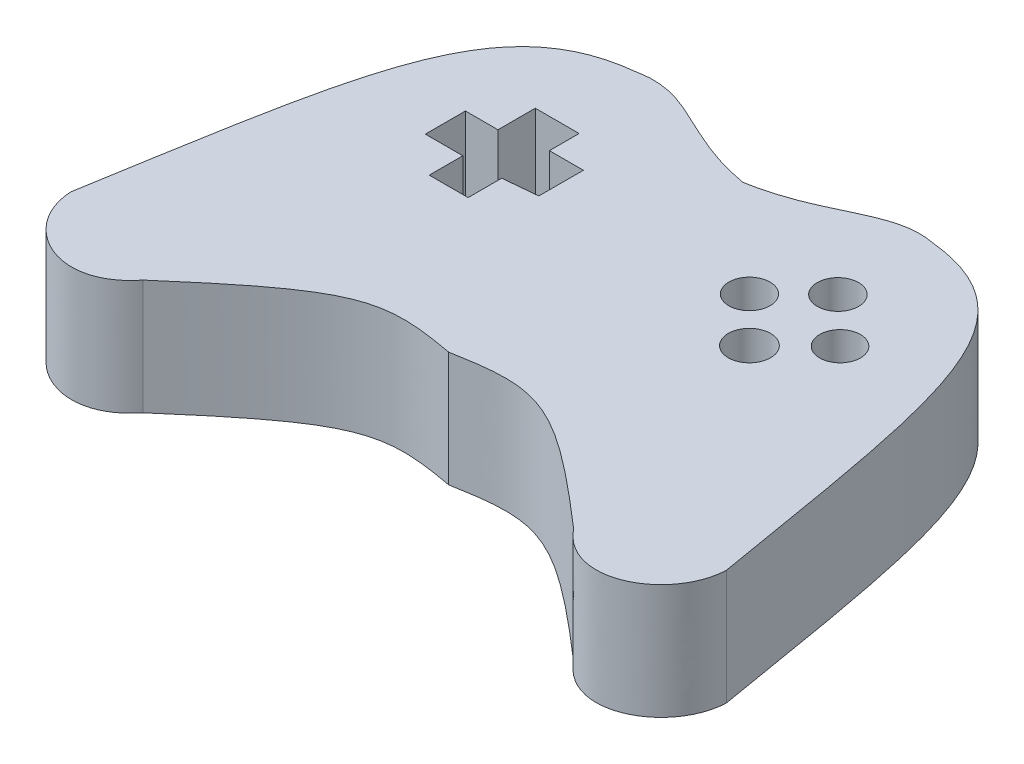
ISO-10303-21;
HEADER;
FILE_DESCRIPTION(('STEP AP214'),'2;1');
FILE_NAME('part.step','',(''),(''),'','','');
FILE_SCHEMA(('AUTOMOTIVE_DESIGN { 1 0 10303 214 1 1 1 1 }'));
ENDSEC;
DATA;
#1=APPLICATION_CONTEXT('core data for automotive mechanical design processes');
#2=APPLICATION_PROTOCOL_DEFINITION('international standard','automotive_design',2000,#1);
#3=PRODUCT_CONTEXT('',#1,'mechanical');
#4=PRODUCT('Part','Part','',(#3));
#5=PRODUCT_RELATED_PRODUCT_CATEGORY('part','',(#4));
#6=PRODUCT_DEFINITION_FORMATION('','',#4);
#7=PRODUCT_DEFINITION_CONTEXT('part definition',#1,'design');
#8=PRODUCT_DEFINITION('design','',#6,#7);
#9=PRODUCT_DEFINITION_SHAPE('','',#8);
#10=(LENGTH_UNIT() NAMED_UNIT(*) SI_UNIT(.MILLI.,.METRE.));
#11=(NAMED_UNIT(*) PLANE_ANGLE_UNIT() SI_UNIT($,.RADIAN.));
#12=(NAMED_UNIT(*) SI_UNIT($,.STERADIAN.) SOLID_ANGLE_UNIT());
#13=UNCERTAINTY_MEASURE_WITH_UNIT(LENGTH_MEASURE(1.E-05),#10,'distance_accuracy_value','');
#14=(GEOMETRIC_REPRESENTATION_CONTEXT(3) GLOBAL_UNCERTAINTY_ASSIGNED_CONTEXT((#13)) GLOBAL_UNIT_ASSIGNED_CONTEXT((#10,
#11,#12)) REPRESENTATION_CONTEXT('',''));
#15=CARTESIAN_POINT('',(0.,0.,0.));
#16=DIRECTION('',(0.,0.,1.));
#17=DIRECTION('',(1.,0.,0.));
#18=AXIS2_PLACEMENT_3D('',#15,#16,#17);
#19=CARTESIAN_POINT('',(10.9520559844828,2.,-8.68200228098317));
#20=DIRECTION('',(0.,-1.,0.));
#21=DIRECTION('',(0.,0.,-1.));
#22=AXIS2_PLACEMENT_3D('',#19,#20,#21);
#23=PLANE('',#22);
#24=CARTESIAN_POINT('',(12.0932653668984,2.,-8.90683532947978));
#25=CARTESIAN_POINT('',(11.2479259351028,2.,-9.07590321583892));
#26=CARTESIAN_POINT('',(10.7545368823652,2.,-8.3841668893106));
#27=CARTESIAN_POINT('',(9.51579405655997,2.,-8.16897260293703));
#28=B_SPLINE_CURVE_WITH_KNOTS('',3,(#24,#25,#26,#27),.UNSPECIFIED.,.F.,.F.,(4,4),(0.,1.),.UNSPECIFIED.);
#29=CARTESIAN_POINT('',(12.0932653668984,2.,-8.90683532947978));
#30=VERTEX_POINT('',#29);
#31=CARTESIAN_POINT('',(9.51579405655997,2.,-8.16897260293703));
#32=VERTEX_POINT('',#31);
#33=EDGE_CURVE('E263',#30,#32,#28,.T.);
#34=ORIENTED_EDGE('',*,*,#33,.T.);
#35=CARTESIAN_POINT('',(9.51579405655997,2.,-8.16897260293703));
#36=CARTESIAN_POINT('',(8.27705123075474,2.,-8.3841668893106));
#37=CARTESIAN_POINT('',(7.78366217801717,2.,-9.07590321583892));
#38=CARTESIAN_POINT('',(6.9383227462215,2.,-8.90683532947978));
#39=B_SPLINE_CURVE_WITH_KNOTS('',3,(#35,#36,#37,#38),.UNSPECIFIED.,.F.,.F.,(4,4),(0.,1.),.UNSPECIFIED.);
#40=CARTESIAN_POINT('',(6.9383227462215,2.,-8.90683532947978));
#41=VERTEX_POINT('',#40);
#42=EDGE_CURVE('E269',#32,#41,#39,.T.);
#43=ORIENTED_EDGE('',*,*,#42,.T.);
#44=CARTESIAN_POINT('',(6.9383227462215,2.,-8.90683532947978));
#45=CARTESIAN_POINT('',(4.78622375194256,2.,-8.67625329437847));
#46=CARTESIAN_POINT('',(4.56793449938139,2.,-6.6378823643764));
#47=CARTESIAN_POINT('',(3.81470387052384,2.,-2.17998680583167));
#48=B_SPLINE_CURVE_WITH_KNOTS('',3,(#44,#45,#46,#47),.UNSPECIFIED.,.F.,.F.,(4,4),(0.,1.),.UNSPECIFIED.);
#49=CARTESIAN_POINT('',(3.81470387052384,2.,-2.17998680583167));
#50=VERTEX_POINT('',#49);
#51=EDGE_CURVE('E278',#41,#50,#48,.T.);
#52=ORIENTED_EDGE('',*,*,#51,.T.);
#53=CARTESIAN_POINT('',(3.81470387052384,2.,-2.17998680583167));
#54=CARTESIAN_POINT('',(3.85569382971372,2.,-1.23721774446444));
#55=CARTESIAN_POINT('',(5.06294709652017,2.,-0.587465172967495));
#56=CARTESIAN_POINT('',(5.77004009586214,2.,-1.47901721561606));
#57=B_SPLINE_CURVE_WITH_KNOTS('',3,(#53,#54,#55,#56),.UNSPECIFIED.,.F.,.F.,(4,4),(0.,1.),.UNSPECIFIED.);
#58=CARTESIAN_POINT('',(5.77004009586214,2.,-1.47901721561606));
#59=VERTEX_POINT('',#58);
#60=EDGE_CURVE('E301',#50,#59,#57,.T.);
#61=ORIENTED_EDGE('',*,*,#60,.T.);
#62=CARTESIAN_POINT('',(5.77004009586213,2.,-1.47901721561606));
#63=CARTESIAN_POINT('',(7.78377159732675,2.,-3.2314247817761));
#64=CARTESIAN_POINT('',(8.15406491330064,2.,-3.29906397158742));
#65=CARTESIAN_POINT('',(9.51579405655997,2.,-3.05312436557393));
#66=B_SPLINE_CURVE_WITH_KNOTS('',3,(#62,#63,#64,#65),.UNSPECIFIED.,.F.,.F.,(4,4),(0.,1.),.UNSPECIFIED.);
#67=CARTESIAN_POINT('',(9.51579405655997,2.,-3.05312436557393));
#68=VERTEX_POINT('',#67);
#69=EDGE_CURVE('E305',#59,#68,#66,.T.);
#70=ORIENTED_EDGE('',*,*,#69,.T.);
#71=CARTESIAN_POINT('',(9.51579405655996,2.,-3.05312436557393));
#72=CARTESIAN_POINT('',(10.8775231998193,2.,-3.29906397158742));
#73=CARTESIAN_POINT('',(11.2478165157932,2.,-3.2314247817761));
#74=CARTESIAN_POINT('',(13.2615480172578,2.,-1.47901721561606));
#75=B_SPLINE_CURVE_WITH_KNOTS('',3,(#71,#72,#73,#74),.UNSPECIFIED.,.F.,.F.,(4,4),(0.,1.),.UNSPECIFIED.);
#76=CARTESIAN_POINT('',(13.2615480172578,2.,-1.47901721561606));
#77=VERTEX_POINT('',#76);
#78=EDGE_CURVE('E313',#68,#77,#75,.T.);
#79=ORIENTED_EDGE('',*,*,#78,.T.);
#80=CARTESIAN_POINT('',(13.2615480172578,2.,-1.47901721561606));
#81=CARTESIAN_POINT('',(13.9686410165998,2.,-0.587465172967495));
#82=CARTESIAN_POINT('',(15.1758942834062,2.,-1.23721774446444));
#83=CARTESIAN_POINT('',(15.2168842425961,2.,-2.17998680583167));
#84=B_SPLINE_CURVE_WITH_KNOTS('',3,(#80,#81,#82,#83),.UNSPECIFIED.,.F.,.F.,(4,4),(0.,1.),.UNSPECIFIED.);
#85=CARTESIAN_POINT('',(15.2168842425961,2.,-2.17998680583167));
#86=VERTEX_POINT('',#85);
#87=EDGE_CURVE('E321',#77,#86,#84,.T.);
#88=ORIENTED_EDGE('',*,*,#87,.T.);
#89=CARTESIAN_POINT('',(15.2168842425961,2.,-2.17998680583167));
#90=CARTESIAN_POINT('',(14.4636536137385,2.,-6.6378823643764));
#91=CARTESIAN_POINT('',(14.2453643611774,2.,-8.67625329437847));
#92=CARTESIAN_POINT('',(12.0932653668984,2.,-8.90683532947978));
#93=B_SPLINE_CURVE_WITH_KNOTS('',3,(#89,#90,#91,#92),.UNSPECIFIED.,.F.,.F.,(4,4),(0.,1.),.UNSPECIFIED.);
#94=EDGE_CURVE('E343',#86,#30,#93,.T.);
#95=ORIENTED_EDGE('',*,*,#94,.T.);
#96=EDGE_LOOP('',(#34,#43,#52,#61,#70,#79,#88,#95));
#97=FACE_BOUND('',#96,.T.);
#98=DIRECTION('',(0.,0.,1.));
#99=VECTOR('',#98,1.);
#100=CARTESIAN_POINT('',(6.59398680716821,2.,-6.83105667385962));
#101=LINE('',#100,#99);
#102=CARTESIAN_POINT('',(6.59398680716821,2.,-7.48030072483046));
#103=VERTEX_POINT('',#102);
#104=CARTESIAN_POINT('',(6.59398680716821,2.,-6.83105667385962));
#105=VERTEX_POINT('',#104);
#106=EDGE_CURVE('E173',#103,#105,#101,.T.);
#107=ORIENTED_EDGE('',*,*,#106,.F.);
#108=DIRECTION('',(-1.,0.,0.));
#109=VECTOR('',#108,1.);
#110=CARTESIAN_POINT('',(6.59398680716821,2.,-7.48030072483046));
#111=LINE('',#110,#109);
#112=CARTESIAN_POINT('',(7.35644495792906,2.,-7.48030072483046));
#113=VERTEX_POINT('',#112);
#114=EDGE_CURVE('E168',#113,#103,#111,.T.);
#115=ORIENTED_EDGE('',*,*,#114,.F.);
#116=DIRECTION('',(0.,0.,-1.));
#117=VECTOR('',#116,1.);
#118=CARTESIAN_POINT('',(7.35644495792906,2.,-7.48030072483046));
#119=LINE('',#118,#117);
#120=CARTESIAN_POINT('',(7.35644495792906,2.,-6.96379681625053));
#121=VERTEX_POINT('',#120);
#122=EDGE_CURVE('E209',#121,#113,#119,.T.);
#123=ORIENTED_EDGE('',*,*,#122,.F.);
#124=DIRECTION('',(-1.,0.,0.));
#125=VECTOR('',#124,1.);
#126=CARTESIAN_POINT('',(7.35644495792906,2.,-6.96379681625053));
#127=LINE('',#126,#125);
#128=CARTESIAN_POINT('',(7.94673513916326,2.,-6.96379681625053));
#129=VERTEX_POINT('',#128);
#130=EDGE_CURVE('E207',#129,#121,#127,.T.);
#131=ORIENTED_EDGE('',*,*,#130,.F.);
#132=DIRECTION('',(0.,0.,-1.));
#133=VECTOR('',#132,1.);
#134=CARTESIAN_POINT('',(7.94673513916326,2.,-6.96379681625053));
#135=LINE('',#134,#133);
#136=CARTESIAN_POINT('',(7.94673513916326,2.,-6.18904095338064));
#137=VERTEX_POINT('',#136);
#138=EDGE_CURVE('E205',#137,#129,#135,.T.);
#139=ORIENTED_EDGE('',*,*,#138,.F.);
#140=DIRECTION('',(0.995576555575533,0.,-0.0939538290244594));
#141=VECTOR('',#140,1.);
#142=CARTESIAN_POINT('',(7.94673513916326,2.,-6.18904095338064));
#143=LINE('',#142,#141);
#144=CARTESIAN_POINT('',(7.35644495792906,2.,-6.13333451628959));
#145=VERTEX_POINT('',#144);
#146=EDGE_CURVE('E203',#145,#137,#143,.T.);
#147=ORIENTED_EDGE('',*,*,#146,.F.);
#148=DIRECTION('',(0.,0.,-1.));
#149=VECTOR('',#148,1.);
#150=CARTESIAN_POINT('',(7.35644495792906,2.,-6.13333451628959));
#151=LINE('',#150,#149);
#152=CARTESIAN_POINT('',(7.35644495792906,2.,-5.54955992371025));
#153=VERTEX_POINT('',#152);
#154=EDGE_CURVE('E201',#153,#145,#151,.T.);
#155=ORIENTED_EDGE('',*,*,#154,.F.);
#156=DIRECTION('',(1.,0.,0.));
#157=VECTOR('',#156,1.);
#158=CARTESIAN_POINT('',(7.35644495792906,2.,-5.54955992371025));
#159=LINE('',#158,#157);
#160=CARTESIAN_POINT('',(6.68007079193153,2.,-5.54955992371025));
#161=VERTEX_POINT('',#160);
#162=EDGE_CURVE('E199',#161,#153,#159,.T.);
#163=ORIENTED_EDGE('',*,*,#162,.F.);
#164=DIRECTION('',(0.,0.,1.));
#165=VECTOR('',#164,1.);
#166=CARTESIAN_POINT('',(6.68007079193153,2.,-5.54955992371025));
#167=LINE('',#166,#165);
#168=CARTESIAN_POINT('',(6.68007079193153,2.,-6.13333451628959));
#169=VERTEX_POINT('',#168);
#170=EDGE_CURVE('E197',#169,#161,#167,.T.);
#171=ORIENTED_EDGE('',*,*,#170,.F.);
#172=DIRECTION('',(1.,0.,0.));
#173=VECTOR('',#172,1.);
#174=CARTESIAN_POINT('',(6.68007079193153,2.,-6.13333451628959));
#175=LINE('',#174,#173);
#176=CARTESIAN_POINT('',(6.0282920501521,2.,-6.13333451628959));
#177=VERTEX_POINT('',#176);
#178=EDGE_CURVE('E195',#177,#169,#175,.T.);
#179=ORIENTED_EDGE('',*,*,#178,.F.);
#180=DIRECTION('',(0.,0.,1.));
#181=VECTOR('',#180,1.);
#182=CARTESIAN_POINT('',(6.0282920501521,2.,-6.13333451628959));
#183=LINE('',#182,#181);
#184=CARTESIAN_POINT('',(6.0282920501521,2.,-6.83105667385962));
#185=VERTEX_POINT('',#184);
#186=EDGE_CURVE('E190',#185,#177,#183,.T.);
#187=ORIENTED_EDGE('',*,*,#186,.F.);
#188=DIRECTION('',(-1.,0.,0.));
#189=VECTOR('',#188,1.);
#190=CARTESIAN_POINT('',(6.0282920501521,2.,-6.83105667385962));
#191=LINE('',#190,#189);
#192=EDGE_CURVE('E188',#105,#185,#191,.T.);
#193=ORIENTED_EDGE('',*,*,#192,.F.);
#194=EDGE_LOOP('',(#107,#115,#123,#131,#139,#147,#155,#163,#171,#179,#187,#193));
#195=FACE_BOUND('',#194,.T.);
#196=CARTESIAN_POINT('',(11.2542571481743,2.,-6.5450843014299));
#197=DIRECTION('',(0.,1.,0.));
#198=DIRECTION('',(0.,0.,1.));
#199=AXIS2_PLACEMENT_3D('',#196,#197,#198);
#200=CIRCLE('',#199,0.358119716632513);
#201=CARTESIAN_POINT('',(11.2542571481743,2.,-6.18696458479739));
#202=VERTEX_POINT('',#201);
#203=EDGE_CURVE('E213',#202,#202,#200,.T.);
#204=ORIENTED_EDGE('',*,*,#203,.F.);
#205=EDGE_LOOP('',(#204));
#206=FACE_BOUND('',#205,.T.);
#207=CARTESIAN_POINT('',(12.0325721130959,2.,-5.76676933650826));
#208=DIRECTION('',(0.,1.,0.));
#209=DIRECTION('',(0.,0.,1.));
#210=AXIS2_PLACEMENT_3D('',#207,#208,#209);
#211=CIRCLE('',#210,0.367977628179687);
#212=CARTESIAN_POINT('',(12.0325721130959,2.,-5.39879170832857));
#213=VERTEX_POINT('',#212);
#214=EDGE_CURVE('E539',#213,#213,#211,.T.);
#215=ORIENTED_EDGE('',*,*,#214,.F.);
#216=EDGE_LOOP('',(#215));
#217=FACE_BOUND('',#216,.T.);
#218=CARTESIAN_POINT('',(12.8305124874836,2.,-6.5450843014299));
#219=DIRECTION('',(0.,1.,0.));
#220=DIRECTION('',(0.,0.,1.));
#221=AXIS2_PLACEMENT_3D('',#218,#219,#220);
#222=CIRCLE('',#221,0.354400667190584);
#223=CARTESIAN_POINT('',(12.8305124874836,2.,-6.19068363423932));
#224=VERTEX_POINT('',#223);
#225=EDGE_CURVE('E533',#224,#224,#222,.T.);
#226=ORIENTED_EDGE('',*,*,#225,.F.);
#227=EDGE_LOOP('',(#226));
#228=FACE_BOUND('',#227,.T.);
#229=CARTESIAN_POINT('',(12.0325721130959,2.,-7.30601851128472));
#230=DIRECTION('',(0.,1.,0.));
#231=DIRECTION('',(0.,0.,1.));
#232=AXIS2_PLACEMENT_3D('',#229,#230,#231);
#233=CIRCLE('',#232,0.36000999862229);
#234=CARTESIAN_POINT('',(12.0325721130959,2.,-6.94600851266243));
#235=VERTEX_POINT('',#234);
#236=EDGE_CURVE('E524',#235,#235,#233,.T.);
#237=ORIENTED_EDGE('',*,*,#236,.F.);
#238=EDGE_LOOP('',(#237));
#239=FACE_BOUND('',#238,.T.);
#240=ADVANCED_FACE('F33',(#97,#195,#206,#217,#228,#239),#23,.F.);
#241=CARTESIAN_POINT('',(10.9520559844828,0.,-8.68200228098317));
#242=DIRECTION('',(0.,-1.,0.));
#243=DIRECTION('',(0.,0.,-1.));
#244=AXIS2_PLACEMENT_3D('',#241,#242,#243);
#245=PLANE('',#244);
#246=CARTESIAN_POINT('',(12.8305124874836,0.,-6.5450843014299));
#247=DIRECTION('',(0.,1.,0.));
#248=DIRECTION('',(0.,0.,1.));
#249=AXIS2_PLACEMENT_3D('',#246,#247,#248);
#250=CIRCLE('',#249,0.354400667190584);
#251=CARTESIAN_POINT('',(12.8305124874836,0.,-6.19068363423932));
#252=VERTEX_POINT('',#251);
#253=EDGE_CURVE('E530',#252,#252,#250,.T.);
#254=ORIENTED_EDGE('',*,*,#253,.T.);
#255=EDGE_LOOP('',(#254));
#256=FACE_BOUND('',#255,.T.);
#257=CARTESIAN_POINT('',(11.2542571481743,0.,-6.5450843014299));
#258=DIRECTION('',(0.,1.,0.));
#259=DIRECTION('',(0.,0.,1.));
#260=AXIS2_PLACEMENT_3D('',#257,#258,#259);
#261=CIRCLE('',#260,0.358119716632513);
#262=CARTESIAN_POINT('',(11.2542571481743,0.,-6.18696458479739));
#263=VERTEX_POINT('',#262);
#264=EDGE_CURVE('E542',#263,#263,#261,.T.);
#265=ORIENTED_EDGE('',*,*,#264,.T.);
#266=EDGE_LOOP('',(#265));
#267=FACE_BOUND('',#266,.T.);
#268=CARTESIAN_POINT('',(12.0932653668984,0.,-8.90683532947978));
#269=CARTESIAN_POINT('',(11.2479259351028,0.,-9.07590321583892));
#270=CARTESIAN_POINT('',(10.7545368823652,0.,-8.3841668893106));
#271=CARTESIAN_POINT('',(9.51579405655997,0.,-8.16897260293703));
#272=B_SPLINE_CURVE_WITH_KNOTS('',3,(#268,#269,#270,#271),.UNSPECIFIED.,.F.,.F.,(4,4),(0.,1.),.UNSPECIFIED.);
#273=CARTESIAN_POINT('',(12.0932653668984,0.,-8.90683532947978));
#274=VERTEX_POINT('',#273);
#275=CARTESIAN_POINT('',(9.51579405655997,0.,-8.16897260293703));
#276=VERTEX_POINT('',#275);
#277=EDGE_CURVE('E182',#274,#276,#272,.T.);
#278=ORIENTED_EDGE('',*,*,#277,.F.);
#279=CARTESIAN_POINT('',(15.2168842425961,0.,-2.17998680583167));
#280=CARTESIAN_POINT('',(14.4636536137385,0.,-6.6378823643764));
#281=CARTESIAN_POINT('',(14.2453643611774,0.,-8.67625329437847));
#282=CARTESIAN_POINT('',(12.0932653668984,0.,-8.90683532947978));
#283=B_SPLINE_CURVE_WITH_KNOTS('',3,(#279,#280,#281,#282),.UNSPECIFIED.,.F.,.F.,(4,4),(0.,1.),.UNSPECIFIED.);
#284=CARTESIAN_POINT('',(15.2168842425961,0.,-2.17998680583167));
#285=VERTEX_POINT('',#284);
#286=EDGE_CURVE('E270',#285,#274,#283,.T.);
#287=ORIENTED_EDGE('',*,*,#286,.F.);
#288=CARTESIAN_POINT('',(13.2615480172578,0.,-1.47901721561606));
#289=CARTESIAN_POINT('',(13.9686410165998,0.,-0.587465172967495));
#290=CARTESIAN_POINT('',(15.1758942834062,0.,-1.23721774446444));
#291=CARTESIAN_POINT('',(15.2168842425961,0.,-2.17998680583167));
#292=B_SPLINE_CURVE_WITH_KNOTS('',3,(#288,#289,#290,#291),.UNSPECIFIED.,.F.,.F.,(4,4),(0.,1.),.UNSPECIFIED.);
#293=CARTESIAN_POINT('',(13.2615480172578,0.,-1.47901721561606));
#294=VERTEX_POINT('',#293);
#295=EDGE_CURVE('E391',#294,#285,#292,.T.);
#296=ORIENTED_EDGE('',*,*,#295,.F.);
#297=CARTESIAN_POINT('',(9.51579405655996,0.,-3.05312436557393));
#298=CARTESIAN_POINT('',(10.8775231998193,0.,-3.29906397158742));
#299=CARTESIAN_POINT('',(11.2478165157932,0.,-3.2314247817761));
#300=CARTESIAN_POINT('',(13.2615480172578,0.,-1.47901721561606));
#301=B_SPLINE_CURVE_WITH_KNOTS('',3,(#297,#298,#299,#300),.UNSPECIFIED.,.F.,.F.,(4,4),(0.,1.),.UNSPECIFIED.);
#302=CARTESIAN_POINT('',(9.51579405655997,0.,-3.05312436557393));
#303=VERTEX_POINT('',#302);
#304=EDGE_CURVE('E384',#303,#294,#301,.T.);
#305=ORIENTED_EDGE('',*,*,#304,.F.);
#306=CARTESIAN_POINT('',(5.77004009586213,0.,-1.47901721561606));
#307=CARTESIAN_POINT('',(7.78377159732675,0.,-3.2314247817761));
#308=CARTESIAN_POINT('',(8.15406491330064,0.,-3.29906397158742));
#309=CARTESIAN_POINT('',(9.51579405655997,0.,-3.05312436557393));
#310=B_SPLINE_CURVE_WITH_KNOTS('',3,(#306,#307,#308,#309),.UNSPECIFIED.,.F.,.F.,(4,4),(0.,1.),.UNSPECIFIED.);
#311=CARTESIAN_POINT('',(5.77004009586214,0.,-1.47901721561606));
#312=VERTEX_POINT('',#311);
#313=EDGE_CURVE('E377',#312,#303,#310,.T.);
#314=ORIENTED_EDGE('',*,*,#313,.F.);
#315=CARTESIAN_POINT('',(3.81470387052384,0.,-2.17998680583167));
#316=CARTESIAN_POINT('',(3.85569382971372,0.,-1.23721774446444));
#317=CARTESIAN_POINT('',(5.06294709652017,0.,-0.587465172967495));
#318=CARTESIAN_POINT('',(5.77004009586214,0.,-1.47901721561606));
#319=B_SPLINE_CURVE_WITH_KNOTS('',3,(#315,#316,#317,#318),.UNSPECIFIED.,.F.,.F.,(4,4),(0.,1.),.UNSPECIFIED.);
#320=CARTESIAN_POINT('',(3.81470387052384,0.,-2.17998680583167));
#321=VERTEX_POINT('',#320);
#322=EDGE_CURVE('E370',#321,#312,#319,.T.);
#323=ORIENTED_EDGE('',*,*,#322,.F.);
#324=CARTESIAN_POINT('',(6.9383227462215,0.,-8.90683532947978));
#325=CARTESIAN_POINT('',(4.78622375194256,0.,-8.67625329437847));
#326=CARTESIAN_POINT('',(4.56793449938139,0.,-6.6378823643764));
#327=CARTESIAN_POINT('',(3.81470387052384,0.,-2.17998680583167));
#328=B_SPLINE_CURVE_WITH_KNOTS('',3,(#324,#325,#326,#327),.UNSPECIFIED.,.F.,.F.,(4,4),(0.,1.),.UNSPECIFIED.);
#329=CARTESIAN_POINT('',(6.9383227462215,0.,-8.90683532947978));
#330=VERTEX_POINT('',#329);
#331=EDGE_CURVE('E363',#330,#321,#328,.T.);
#332=ORIENTED_EDGE('',*,*,#331,.F.);
#333=CARTESIAN_POINT('',(9.51579405655997,0.,-8.16897260293703));
#334=CARTESIAN_POINT('',(8.27705123075474,0.,-8.3841668893106));
#335=CARTESIAN_POINT('',(7.78366217801717,0.,-9.07590321583892));
#336=CARTESIAN_POINT('',(6.9383227462215,0.,-8.90683532947978));
#337=B_SPLINE_CURVE_WITH_KNOTS('',3,(#333,#334,#335,#336),.UNSPECIFIED.,.F.,.F.,(4,4),(0.,1.),.UNSPECIFIED.);
#338=EDGE_CURVE('E356',#276,#330,#337,.T.);
#339=ORIENTED_EDGE('',*,*,#338,.F.);
#340=EDGE_LOOP('',(#278,#287,#296,#305,#314,#323,#332,#339));
#341=FACE_BOUND('',#340,.T.);
#342=DIRECTION('',(-1.,0.,0.));
#343=VECTOR('',#342,1.);
#344=CARTESIAN_POINT('',(6.68007079193153,0.,-7.48030072483046));
#345=LINE('',#344,#343);
#346=CARTESIAN_POINT('',(7.35644495792906,0.,-7.48030072483046));
#347=VERTEX_POINT('',#346);
#348=CARTESIAN_POINT('',(6.59398680716821,0.,-7.48030072483046));
#349=VERTEX_POINT('',#348);
#350=EDGE_CURVE('E174',#347,#349,#345,.T.);
#351=ORIENTED_EDGE('',*,*,#350,.T.);
#352=DIRECTION('',(0.,0.,1.));
#353=VECTOR('',#352,1.);
#354=CARTESIAN_POINT('',(6.59398680716821,0.,-6.83105667385962));
#355=LINE('',#354,#353);
#356=CARTESIAN_POINT('',(6.59398680716821,0.,-6.83105667385962));
#357=VERTEX_POINT('',#356);
#358=EDGE_CURVE('E180',#349,#357,#355,.T.);
#359=ORIENTED_EDGE('',*,*,#358,.T.);
#360=DIRECTION('',(-1.,0.,0.));
#361=VECTOR('',#360,1.);
#362=CARTESIAN_POINT('',(6.0282920501521,0.,-6.83105667385962));
#363=LINE('',#362,#361);
#364=CARTESIAN_POINT('',(6.0282920501521,0.,-6.83105667385962));
#365=VERTEX_POINT('',#364);
#366=EDGE_CURVE('E212',#357,#365,#363,.T.);
#367=ORIENTED_EDGE('',*,*,#366,.T.);
#368=DIRECTION('',(0.,0.,1.));
#369=VECTOR('',#368,1.);
#370=CARTESIAN_POINT('',(6.0282920501521,0.,-6.13333451628959));
#371=LINE('',#370,#369);
#372=CARTESIAN_POINT('',(6.0282920501521,0.,-6.13333451628959));
#373=VERTEX_POINT('',#372);
#374=EDGE_CURVE('E216',#365,#373,#371,.T.);
#375=ORIENTED_EDGE('',*,*,#374,.T.);
#376=DIRECTION('',(1.,0.,0.));
#377=VECTOR('',#376,1.);
#378=CARTESIAN_POINT('',(6.68007079193153,0.,-6.13333451628959));
#379=LINE('',#378,#377);
#380=CARTESIAN_POINT('',(6.68007079193153,0.,-6.13333451628959));
#381=VERTEX_POINT('',#380);
#382=EDGE_CURVE('E219',#373,#381,#379,.T.);
#383=ORIENTED_EDGE('',*,*,#382,.T.);
#384=DIRECTION('',(0.,0.,1.));
#385=VECTOR('',#384,1.);
#386=CARTESIAN_POINT('',(6.68007079193153,0.,-5.54955992371025));
#387=LINE('',#386,#385);
#388=CARTESIAN_POINT('',(6.68007079193153,0.,-5.54955992371025));
#389=VERTEX_POINT('',#388);
#390=EDGE_CURVE('E222',#381,#389,#387,.T.);
#391=ORIENTED_EDGE('',*,*,#390,.T.);
#392=DIRECTION('',(1.,0.,0.));
#393=VECTOR('',#392,1.);
#394=CARTESIAN_POINT('',(7.35644495792906,0.,-5.54955992371025));
#395=LINE('',#394,#393);
#396=CARTESIAN_POINT('',(7.35644495792906,0.,-5.54955992371025));
#397=VERTEX_POINT('',#396);
#398=EDGE_CURVE('E225',#389,#397,#395,.T.);
#399=ORIENTED_EDGE('',*,*,#398,.T.);
#400=DIRECTION('',(0.,0.,-1.));
#401=VECTOR('',#400,1.);
#402=CARTESIAN_POINT('',(7.35644495792906,0.,-6.13333451628959));
#403=LINE('',#402,#401);
#404=CARTESIAN_POINT('',(7.35644495792906,0.,-6.13333451628959));
#405=VERTEX_POINT('',#404);
#406=EDGE_CURVE('E228',#397,#405,#403,.T.);
#407=ORIENTED_EDGE('',*,*,#406,.T.);
#408=DIRECTION('',(0.995576555575533,0.,-0.0939538290244594));
#409=VECTOR('',#408,1.);
#410=CARTESIAN_POINT('',(7.94673513916326,0.,-6.18904095338064));
#411=LINE('',#410,#409);
#412=CARTESIAN_POINT('',(7.94673513916326,0.,-6.18904095338064));
#413=VERTEX_POINT('',#412);
#414=EDGE_CURVE('E231',#405,#413,#411,.T.);
#415=ORIENTED_EDGE('',*,*,#414,.T.);
#416=DIRECTION('',(0.,0.,-1.));
#417=VECTOR('',#416,1.);
#418=CARTESIAN_POINT('',(7.94673513916326,0.,-6.96379681625053));
#419=LINE('',#418,#417);
#420=CARTESIAN_POINT('',(7.94673513916326,0.,-6.96379681625053));
#421=VERTEX_POINT('',#420);
#422=EDGE_CURVE('E234',#413,#421,#419,.T.);
#423=ORIENTED_EDGE('',*,*,#422,.T.);
#424=DIRECTION('',(-1.,0.,0.));
#425=VECTOR('',#424,1.);
#426=CARTESIAN_POINT('',(7.35644495792906,0.,-6.96379681625053));
#427=LINE('',#426,#425);
#428=CARTESIAN_POINT('',(7.35644495792906,0.,-6.96379681625053));
#429=VERTEX_POINT('',#428);
#430=EDGE_CURVE('E237',#421,#429,#427,.T.);
#431=ORIENTED_EDGE('',*,*,#430,.T.);
#432=DIRECTION('',(0.,0.,-1.));
#433=VECTOR('',#432,1.);
#434=CARTESIAN_POINT('',(7.35644495792906,0.,-7.48030072483046));
#435=LINE('',#434,#433);
#436=EDGE_CURVE('E240',#429,#347,#435,.T.);
#437=ORIENTED_EDGE('',*,*,#436,.T.);
#438=EDGE_LOOP('',(#351,#359,#367,#375,#383,#391,#399,#407,#415,#423,#431,#437));
#439=FACE_BOUND('',#438,.T.);
#440=CARTESIAN_POINT('',(12.0325721130959,0.,-5.76676933650826));
#441=DIRECTION('',(0.,1.,0.));
#442=DIRECTION('',(0.,0.,1.));
#443=AXIS2_PLACEMENT_3D('',#440,#441,#442);
#444=CIRCLE('',#443,0.367977628179687);
#445=CARTESIAN_POINT('',(12.0325721130959,0.,-5.39879170832857));
#446=VERTEX_POINT('',#445);
#447=EDGE_CURVE('E536',#446,#446,#444,.T.);
#448=ORIENTED_EDGE('',*,*,#447,.T.);
#449=EDGE_LOOP('',(#448));
#450=FACE_BOUND('',#449,.T.);
#451=CARTESIAN_POINT('',(12.0325721130959,0.,-7.30601851128472));
#452=DIRECTION('',(0.,1.,0.));
#453=DIRECTION('',(0.,0.,1.));
#454=AXIS2_PLACEMENT_3D('',#451,#452,#453);
#455=CIRCLE('',#454,0.36000999862229);
#456=CARTESIAN_POINT('',(12.0325721130959,0.,-6.94600851266243));
#457=VERTEX_POINT('',#456);
#458=EDGE_CURVE('E527',#457,#457,#455,.T.);
#459=ORIENTED_EDGE('',*,*,#458,.T.);
#460=EDGE_LOOP('',(#459));
#461=FACE_BOUND('',#460,.T.);
#462=ADVANCED_FACE('F341',(#256,#267,#341,#439,#450,#461),#245,.T.);
#463=DIRECTION('',(0.,-1.,0.));
#464=VECTOR('',#463,1.);
#465=SURFACE_OF_LINEAR_EXTRUSION('',#28,#464);
#466=ORIENTED_EDGE('',*,*,#277,.T.);
#467=DIRECTION('',(0.,-1.,0.));
#468=VECTOR('',#467,1.);
#469=CARTESIAN_POINT('',(9.51579405655997,2.,-8.16897260293703));
#470=LINE('',#469,#468);
#471=EDGE_CURVE('E11',#32,#276,#470,.T.);
#472=ORIENTED_EDGE('',*,*,#471,.F.);
#473=ORIENTED_EDGE('',*,*,#33,.F.);
#474=DIRECTION('',(0.,-1.,0.));
#475=VECTOR('',#474,1.);
#476=CARTESIAN_POINT('',(12.0932653668984,2.,-8.90683532947978));
#477=LINE('',#476,#475);
#478=EDGE_CURVE('E348',#30,#274,#477,.T.);
#479=ORIENTED_EDGE('',*,*,#478,.T.);
#480=EDGE_LOOP('',(#466,#472,#473,#479));
#481=FACE_BOUND('',#480,.T.);
#482=ADVANCED_FACE('F35',(#481),#465,.F.);
#483=DIRECTION('',(0.,-1.,0.));
#484=VECTOR('',#483,1.);
#485=SURFACE_OF_LINEAR_EXTRUSION('',#39,#484);
#486=ORIENTED_EDGE('',*,*,#338,.T.);
#487=DIRECTION('',(0.,-1.,0.));
#488=VECTOR('',#487,1.);
#489=CARTESIAN_POINT('',(6.9383227462215,2.,-8.90683532947978));
#490=LINE('',#489,#488);
#491=EDGE_CURVE('E42',#41,#330,#490,.T.);
#492=ORIENTED_EDGE('',*,*,#491,.F.);
#493=ORIENTED_EDGE('',*,*,#42,.F.);
#494=ORIENTED_EDGE('',*,*,#471,.T.);
#495=EDGE_LOOP('',(#486,#492,#493,#494));
#496=FACE_BOUND('',#495,.T.);
#497=ADVANCED_FACE('F286',(#496),#485,.F.);
#498=DIRECTION('',(0.,-1.,0.));
#499=VECTOR('',#498,1.);
#500=SURFACE_OF_LINEAR_EXTRUSION('',#48,#499);
#501=ORIENTED_EDGE('',*,*,#331,.T.);
#502=DIRECTION('',(0.,-1.,0.));
#503=VECTOR('',#502,1.);
#504=CARTESIAN_POINT('',(3.81470387052384,2.,-2.17998680583167));
#505=LINE('',#504,#503);
#506=EDGE_CURVE('E421',#50,#321,#505,.T.);
#507=ORIENTED_EDGE('',*,*,#506,.F.);
#508=ORIENTED_EDGE('',*,*,#51,.F.);
#509=ORIENTED_EDGE('',*,*,#491,.T.);
#510=EDGE_LOOP('',(#501,#507,#508,#509));
#511=FACE_BOUND('',#510,.T.);
#512=ADVANCED_FACE('F289',(#511),#500,.F.);
#513=DIRECTION('',(0.,-1.,0.));
#514=VECTOR('',#513,1.);
#515=SURFACE_OF_LINEAR_EXTRUSION('',#57,#514);
#516=ORIENTED_EDGE('',*,*,#322,.T.);
#517=DIRECTION('',(0.,-1.,0.));
#518=VECTOR('',#517,1.);
#519=CARTESIAN_POINT('',(5.77004009586214,2.,-1.47901721561606));
#520=LINE('',#519,#518);
#521=EDGE_CURVE('E418',#59,#312,#520,.T.);
#522=ORIENTED_EDGE('',*,*,#521,.F.);
#523=ORIENTED_EDGE('',*,*,#60,.F.);
#524=ORIENTED_EDGE('',*,*,#506,.T.);
#525=EDGE_LOOP('',(#516,#522,#523,#524));
#526=FACE_BOUND('',#525,.T.);
#527=ADVANCED_FACE('F293',(#526),#515,.F.);
#528=DIRECTION('',(0.,-1.,0.));
#529=VECTOR('',#528,1.);
#530=SURFACE_OF_LINEAR_EXTRUSION('',#66,#529);
#531=ORIENTED_EDGE('',*,*,#313,.T.);
#532=DIRECTION('',(0.,-1.,0.));
#533=VECTOR('',#532,1.);
#534=CARTESIAN_POINT('',(9.51579405655997,2.,-3.05312436557393));
#535=LINE('',#534,#533);
#536=EDGE_CURVE('E415',#68,#303,#535,.T.);
#537=ORIENTED_EDGE('',*,*,#536,.F.);
#538=ORIENTED_EDGE('',*,*,#69,.F.);
#539=ORIENTED_EDGE('',*,*,#521,.T.);
#540=EDGE_LOOP('',(#531,#537,#538,#539));
#541=FACE_BOUND('',#540,.T.);
#542=ADVANCED_FACE('F297',(#541),#530,.F.);
#543=DIRECTION('',(0.,-1.,0.));
#544=VECTOR('',#543,1.);
#545=SURFACE_OF_LINEAR_EXTRUSION('',#75,#544);
#546=ORIENTED_EDGE('',*,*,#304,.T.);
#547=DIRECTION('',(0.,-1.,0.));
#548=VECTOR('',#547,1.);
#549=CARTESIAN_POINT('',(13.2615480172578,2.,-1.47901721561606));
#550=LINE('',#549,#548);
#551=EDGE_CURVE('E412',#77,#294,#550,.T.);
#552=ORIENTED_EDGE('',*,*,#551,.F.);
#553=ORIENTED_EDGE('',*,*,#78,.F.);
#554=ORIENTED_EDGE('',*,*,#536,.T.);
#555=EDGE_LOOP('',(#546,#552,#553,#554));
#556=FACE_BOUND('',#555,.T.);
#557=ADVANCED_FACE('F329',(#556),#545,.F.);
#558=DIRECTION('',(0.,-1.,0.));
#559=VECTOR('',#558,1.);
#560=SURFACE_OF_LINEAR_EXTRUSION('',#84,#559);
#561=ORIENTED_EDGE('',*,*,#295,.T.);
#562=DIRECTION('',(0.,-1.,0.));
#563=VECTOR('',#562,1.);
#564=CARTESIAN_POINT('',(15.2168842425961,2.,-2.17998680583167));
#565=LINE('',#564,#563);
#566=EDGE_CURVE('E409',#86,#285,#565,.T.);
#567=ORIENTED_EDGE('',*,*,#566,.F.);
#568=ORIENTED_EDGE('',*,*,#87,.F.);
#569=ORIENTED_EDGE('',*,*,#551,.T.);
#570=EDGE_LOOP('',(#561,#567,#568,#569));
#571=FACE_BOUND('',#570,.T.);
#572=ADVANCED_FACE('F332',(#571),#560,.F.);
#573=DIRECTION('',(0.,-1.,0.));
#574=VECTOR('',#573,1.);
#575=SURFACE_OF_LINEAR_EXTRUSION('',#93,#574);
#576=ORIENTED_EDGE('',*,*,#286,.T.);
#577=ORIENTED_EDGE('',*,*,#478,.F.);
#578=ORIENTED_EDGE('',*,*,#94,.F.);
#579=ORIENTED_EDGE('',*,*,#566,.T.);
#580=EDGE_LOOP('',(#576,#577,#578,#579));
#581=FACE_BOUND('',#580,.T.);
#582=ADVANCED_FACE('F336',(#581),#575,.F.);
#583=CARTESIAN_POINT('',(6.59398680716821,2.,-6.83105667385962));
#584=DIRECTION('',(1.,0.,0.));
#585=DIRECTION('',(0.,0.,-1.));
#586=AXIS2_PLACEMENT_3D('',#583,#584,#585);
#587=PLANE('',#586);
#588=ORIENTED_EDGE('',*,*,#358,.F.);
#589=DIRECTION('',(0.,-1.,0.));
#590=VECTOR('',#589,1.);
#591=CARTESIAN_POINT('',(6.59398680716821,2.,-7.48030072483046));
#592=LINE('',#591,#590);
#593=EDGE_CURVE('E54',#103,#349,#592,.T.);
#594=ORIENTED_EDGE('',*,*,#593,.F.);
#595=ORIENTED_EDGE('',*,*,#106,.T.);
#596=DIRECTION('',(0.,-1.,0.));
#597=VECTOR('',#596,1.);
#598=CARTESIAN_POINT('',(6.59398680716821,2.,-6.83105667385962));
#599=LINE('',#598,#597);
#600=EDGE_CURVE('E183',#105,#357,#599,.T.);
#601=ORIENTED_EDGE('',*,*,#600,.T.);
#602=EDGE_LOOP('',(#588,#594,#595,#601));
#603=FACE_BOUND('',#602,.T.);
#604=ADVANCED_FACE('F177',(#603),#587,.T.);
#605=CARTESIAN_POINT('',(6.0282920501521,2.,-6.83105667385962));
#606=DIRECTION('',(0.,0.,1.));
#607=DIRECTION('',(1.,0.,0.));
#608=AXIS2_PLACEMENT_3D('',#605,#606,#607);
#609=PLANE('',#608);
#610=ORIENTED_EDGE('',*,*,#366,.F.);
#611=ORIENTED_EDGE('',*,*,#600,.F.);
#612=ORIENTED_EDGE('',*,*,#192,.T.);
#613=DIRECTION('',(0.,-1.,0.));
#614=VECTOR('',#613,1.);
#615=CARTESIAN_POINT('',(6.0282920501521,2.,-6.83105667385962));
#616=LINE('',#615,#614);
#617=EDGE_CURVE('E261',#185,#365,#616,.T.);
#618=ORIENTED_EDGE('',*,*,#617,.T.);
#619=EDGE_LOOP('',(#610,#611,#612,#618));
#620=FACE_BOUND('',#619,.T.);
#621=ADVANCED_FACE('F462',(#620),#609,.T.);
#622=CARTESIAN_POINT('',(6.0282920501521,2.,-6.13333451628959));
#623=DIRECTION('',(1.,0.,0.));
#624=DIRECTION('',(0.,0.,-1.));
#625=AXIS2_PLACEMENT_3D('',#622,#623,#624);
#626=PLANE('',#625);
#627=ORIENTED_EDGE('',*,*,#374,.F.);
#628=ORIENTED_EDGE('',*,*,#617,.F.);
#629=ORIENTED_EDGE('',*,*,#186,.T.);
#630=DIRECTION('',(0.,-1.,0.));
#631=VECTOR('',#630,1.);
#632=CARTESIAN_POINT('',(6.0282920501521,2.,-6.13333451628959));
#633=LINE('',#632,#631);
#634=EDGE_CURVE('E259',#177,#373,#633,.T.);
#635=ORIENTED_EDGE('',*,*,#634,.T.);
#636=EDGE_LOOP('',(#627,#628,#629,#635));
#637=FACE_BOUND('',#636,.T.);
#638=ADVANCED_FACE('F465',(#637),#626,.T.);
#639=CARTESIAN_POINT('',(6.68007079193153,2.,-6.13333451628959));
#640=DIRECTION('',(0.,0.,-1.));
#641=DIRECTION('',(-1.,0.,0.));
#642=AXIS2_PLACEMENT_3D('',#639,#640,#641);
#643=PLANE('',#642);
#644=ORIENTED_EDGE('',*,*,#382,.F.);
#645=ORIENTED_EDGE('',*,*,#634,.F.);
#646=ORIENTED_EDGE('',*,*,#178,.T.);
#647=DIRECTION('',(0.,-1.,0.));
#648=VECTOR('',#647,1.);
#649=CARTESIAN_POINT('',(6.68007079193153,2.,-6.13333451628959));
#650=LINE('',#649,#648);
#651=EDGE_CURVE('E257',#169,#381,#650,.T.);
#652=ORIENTED_EDGE('',*,*,#651,.T.);
#653=EDGE_LOOP('',(#644,#645,#646,#652));
#654=FACE_BOUND('',#653,.T.);
#655=ADVANCED_FACE('F469',(#654),#643,.T.);
#656=CARTESIAN_POINT('',(6.68007079193153,2.,-5.54955992371025));
#657=DIRECTION('',(1.,0.,0.));
#658=DIRECTION('',(0.,0.,-1.));
#659=AXIS2_PLACEMENT_3D('',#656,#657,#658);
#660=PLANE('',#659);
#661=ORIENTED_EDGE('',*,*,#390,.F.);
#662=ORIENTED_EDGE('',*,*,#651,.F.);
#663=ORIENTED_EDGE('',*,*,#170,.T.);
#664=DIRECTION('',(0.,-1.,0.));
#665=VECTOR('',#664,1.);
#666=CARTESIAN_POINT('',(6.68007079193153,2.,-5.54955992371025));
#667=LINE('',#666,#665);
#668=EDGE_CURVE('E255',#161,#389,#667,.T.);
#669=ORIENTED_EDGE('',*,*,#668,.T.);
#670=EDGE_LOOP('',(#661,#662,#663,#669));
#671=FACE_BOUND('',#670,.T.);
#672=ADVANCED_FACE('F473',(#671),#660,.T.);
#673=CARTESIAN_POINT('',(7.35644495792906,2.,-5.54955992371025));
#674=DIRECTION('',(0.,0.,-1.));
#675=DIRECTION('',(-1.,0.,0.));
#676=AXIS2_PLACEMENT_3D('',#673,#674,#675);
#677=PLANE('',#676);
#678=ORIENTED_EDGE('',*,*,#398,.F.);
#679=ORIENTED_EDGE('',*,*,#668,.F.);
#680=ORIENTED_EDGE('',*,*,#162,.T.);
#681=DIRECTION('',(0.,-1.,0.));
#682=VECTOR('',#681,1.);
#683=CARTESIAN_POINT('',(7.35644495792906,2.,-5.54955992371025));
#684=LINE('',#683,#682);
#685=EDGE_CURVE('E253',#153,#397,#684,.T.);
#686=ORIENTED_EDGE('',*,*,#685,.T.);
#687=EDGE_LOOP('',(#678,#679,#680,#686));
#688=FACE_BOUND('',#687,.T.);
#689=ADVANCED_FACE('F477',(#688),#677,.T.);
#690=CARTESIAN_POINT('',(7.35644495792906,2.,-6.13333451628959));
#691=DIRECTION('',(-1.,0.,0.));
#692=DIRECTION('',(0.,0.,1.));
#693=AXIS2_PLACEMENT_3D('',#690,#691,#692);
#694=PLANE('',#693);
#695=ORIENTED_EDGE('',*,*,#406,.F.);
#696=ORIENTED_EDGE('',*,*,#685,.F.);
#697=ORIENTED_EDGE('',*,*,#154,.T.);
#698=DIRECTION('',(0.,-1.,0.));
#699=VECTOR('',#698,1.);
#700=CARTESIAN_POINT('',(7.35644495792906,2.,-6.13333451628959));
#701=LINE('',#700,#699);
#702=EDGE_CURVE('E251',#145,#405,#701,.T.);
#703=ORIENTED_EDGE('',*,*,#702,.T.);
#704=EDGE_LOOP('',(#695,#696,#697,#703));
#705=FACE_BOUND('',#704,.T.);
#706=ADVANCED_FACE('F481',(#705),#694,.T.);
#707=CARTESIAN_POINT('',(7.94673513916326,2.,-6.18904095338064));
#708=DIRECTION('',(-0.0939538290244594,0.,-0.995576555575533));
#709=DIRECTION('',(-0.995576555575533,0.,0.0939538290244594));
#710=AXIS2_PLACEMENT_3D('',#707,#708,#709);
#711=PLANE('',#710);
#712=ORIENTED_EDGE('',*,*,#414,.F.);
#713=ORIENTED_EDGE('',*,*,#702,.F.);
#714=ORIENTED_EDGE('',*,*,#146,.T.);
#715=DIRECTION('',(0.,-1.,0.));
#716=VECTOR('',#715,1.);
#717=CARTESIAN_POINT('',(7.94673513916326,2.,-6.18904095338064));
#718=LINE('',#717,#716);
#719=EDGE_CURVE('E249',#137,#413,#718,.T.);
#720=ORIENTED_EDGE('',*,*,#719,.T.);
#721=EDGE_LOOP('',(#712,#713,#714,#720));
#722=FACE_BOUND('',#721,.T.);
#723=ADVANCED_FACE('F485',(#722),#711,.T.);
#724=CARTESIAN_POINT('',(7.94673513916326,2.,-6.96379681625053));
#725=DIRECTION('',(-1.,0.,0.));
#726=DIRECTION('',(0.,0.,1.));
#727=AXIS2_PLACEMENT_3D('',#724,#725,#726);
#728=PLANE('',#727);
#729=ORIENTED_EDGE('',*,*,#422,.F.);
#730=ORIENTED_EDGE('',*,*,#719,.F.);
#731=ORIENTED_EDGE('',*,*,#138,.T.);
#732=DIRECTION('',(0.,-1.,0.));
#733=VECTOR('',#732,1.);
#734=CARTESIAN_POINT('',(7.94673513916326,2.,-6.96379681625053));
#735=LINE('',#734,#733);
#736=EDGE_CURVE('E247',#129,#421,#735,.T.);
#737=ORIENTED_EDGE('',*,*,#736,.T.);
#738=EDGE_LOOP('',(#729,#730,#731,#737));
#739=FACE_BOUND('',#738,.T.);
#740=ADVANCED_FACE('F489',(#739),#728,.T.);
#741=CARTESIAN_POINT('',(7.35644495792906,2.,-6.96379681625053));
#742=DIRECTION('',(0.,0.,1.));
#743=DIRECTION('',(1.,0.,0.));
#744=AXIS2_PLACEMENT_3D('',#741,#742,#743);
#745=PLANE('',#744);
#746=ORIENTED_EDGE('',*,*,#430,.F.);
#747=ORIENTED_EDGE('',*,*,#736,.F.);
#748=ORIENTED_EDGE('',*,*,#130,.T.);
#749=DIRECTION('',(0.,-1.,0.));
#750=VECTOR('',#749,1.);
#751=CARTESIAN_POINT('',(7.35644495792906,2.,-6.96379681625053));
#752=LINE('',#751,#750);
#753=EDGE_CURVE('E245',#121,#429,#752,.T.);
#754=ORIENTED_EDGE('',*,*,#753,.T.);
#755=EDGE_LOOP('',(#746,#747,#748,#754));
#756=FACE_BOUND('',#755,.T.);
#757=ADVANCED_FACE('F493',(#756),#745,.T.);
#758=CARTESIAN_POINT('',(7.35644495792906,2.,-7.48030072483046));
#759=DIRECTION('',(-1.,0.,0.));
#760=DIRECTION('',(0.,0.,1.));
#761=AXIS2_PLACEMENT_3D('',#758,#759,#760);
#762=PLANE('',#761);
#763=ORIENTED_EDGE('',*,*,#436,.F.);
#764=ORIENTED_EDGE('',*,*,#753,.F.);
#765=ORIENTED_EDGE('',*,*,#122,.T.);
#766=DIRECTION('',(0.,-1.,0.));
#767=VECTOR('',#766,1.);
#768=CARTESIAN_POINT('',(7.35644495792906,2.,-7.48030072483046));
#769=LINE('',#768,#767);
#770=EDGE_CURVE('E49',#113,#347,#769,.T.);
#771=ORIENTED_EDGE('',*,*,#770,.T.);
#772=EDGE_LOOP('',(#763,#764,#765,#771));
#773=FACE_BOUND('',#772,.T.);
#774=ADVANCED_FACE('F497',(#773),#762,.T.);
#775=CARTESIAN_POINT('',(6.68007079193153,2.,-7.48030072483046));
#776=DIRECTION('',(0.,0.,1.));
#777=DIRECTION('',(1.,0.,0.));
#778=AXIS2_PLACEMENT_3D('',#775,#776,#777);
#779=PLANE('',#778);
#780=ORIENTED_EDGE('',*,*,#350,.F.);
#781=ORIENTED_EDGE('',*,*,#770,.F.);
#782=ORIENTED_EDGE('',*,*,#114,.T.);
#783=ORIENTED_EDGE('',*,*,#593,.T.);
#784=EDGE_LOOP('',(#780,#781,#782,#783));
#785=FACE_BOUND('',#784,.T.);
#786=ADVANCED_FACE('F169',(#785),#779,.T.);
#787=CARTESIAN_POINT('',(11.2542571481743,2.,-6.5450843014299));
#788=DIRECTION('',(0.,-1.,0.));
#789=DIRECTION('',(0.,0.,-1.));
#790=AXIS2_PLACEMENT_3D('',#787,#788,#789);
#791=CYLINDRICAL_SURFACE('',#790,0.358119716632513);
#792=ORIENTED_EDGE('',*,*,#203,.T.);
#793=EDGE_LOOP('',(#792));
#794=FACE_BOUND('',#793,.T.);
#795=ORIENTED_EDGE('',*,*,#264,.F.);
#796=EDGE_LOOP('',(#795));
#797=FACE_BOUND('',#796,.T.);
#798=ADVANCED_FACE('F504',(#794,#797),#791,.F.);
#799=CARTESIAN_POINT('',(12.0325721130959,2.,-5.76676933650826));
#800=DIRECTION('',(0.,-1.,0.));
#801=DIRECTION('',(0.,0.,-1.));
#802=AXIS2_PLACEMENT_3D('',#799,#800,#801);
#803=CYLINDRICAL_SURFACE('',#802,0.367977628179687);
#804=ORIENTED_EDGE('',*,*,#214,.T.);
#805=EDGE_LOOP('',(#804));
#806=FACE_BOUND('',#805,.T.);
#807=ORIENTED_EDGE('',*,*,#447,.F.);
#808=EDGE_LOOP('',(#807));
#809=FACE_BOUND('',#808,.T.);
#810=ADVANCED_FACE('F507',(#806,#809),#803,.F.);
#811=CARTESIAN_POINT('',(12.8305124874836,2.,-6.5450843014299));
#812=DIRECTION('',(0.,-1.,0.));
#813=DIRECTION('',(0.,0.,-1.));
#814=AXIS2_PLACEMENT_3D('',#811,#812,#813);
#815=CYLINDRICAL_SURFACE('',#814,0.354400667190584);
#816=ORIENTED_EDGE('',*,*,#225,.T.);
#817=EDGE_LOOP('',(#816));
#818=FACE_BOUND('',#817,.T.);
#819=ORIENTED_EDGE('',*,*,#253,.F.);
#820=EDGE_LOOP('',(#819));
#821=FACE_BOUND('',#820,.T.);
#822=ADVANCED_FACE('F511',(#818,#821),#815,.F.);
#823=CARTESIAN_POINT('',(12.0325721130959,2.,-7.30601851128472));
#824=DIRECTION('',(0.,-1.,0.));
#825=DIRECTION('',(0.,0.,-1.));
#826=AXIS2_PLACEMENT_3D('',#823,#824,#825);
#827=CYLINDRICAL_SURFACE('',#826,0.36000999862229);
#828=ORIENTED_EDGE('',*,*,#236,.T.);
#829=EDGE_LOOP('',(#828));
#830=FACE_BOUND('',#829,.T.);
#831=ORIENTED_EDGE('',*,*,#458,.F.);
#832=EDGE_LOOP('',(#831));
#833=FACE_BOUND('',#832,.T.);
#834=ADVANCED_FACE('F515',(#830,#833),#827,.F.);
#835=CLOSED_SHELL('',(#240,#462,#482,#497,#512,#527,#542,#557,#572,#582,#604,#621,#638,#655,
#672,#689,#706,#723,#740,#757,#774,#786,#798,#810,#822,#834));
#836=MANIFOLD_SOLID_BREP('B2',#835);
#837=ADVANCED_BREP_SHAPE_REPRESENTATION('',(#18,#836),#14);
#838=SHAPE_DEFINITION_REPRESENTATION(#9,#837);
ENDSEC;
END-ISO-10303-21;
